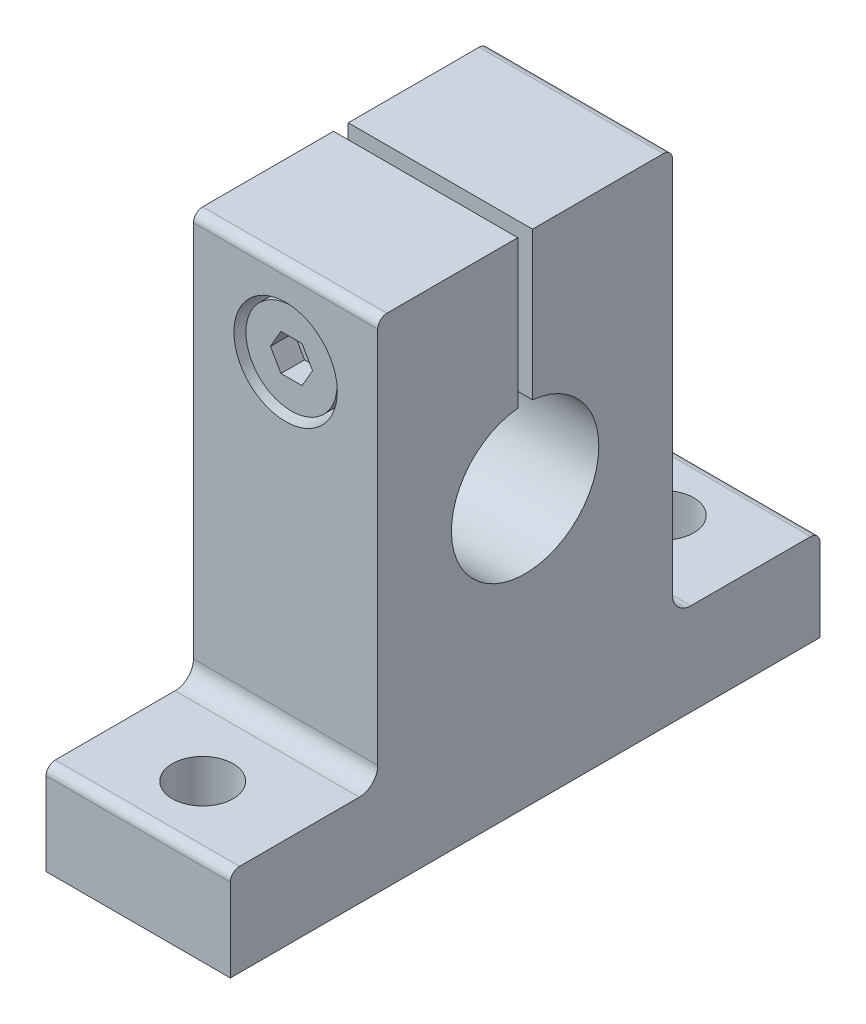
ISO-10303-21;
HEADER;
FILE_DESCRIPTION(('STEP AP214'),'2;1');
FILE_NAME('part.step','',(''),(''),'','','');
FILE_SCHEMA(('AUTOMOTIVE_DESIGN { 1 0 10303 214 1 1 1 1 }'));
ENDSEC;
DATA;
#1=APPLICATION_CONTEXT('core data for automotive mechanical design processes');
#2=APPLICATION_PROTOCOL_DEFINITION('international standard','automotive_design',2000,#1);
#3=PRODUCT_CONTEXT('',#1,'mechanical');
#4=PRODUCT('Part','Part','',(#3));
#5=PRODUCT_RELATED_PRODUCT_CATEGORY('part','',(#4));
#6=PRODUCT_DEFINITION_FORMATION('','',#4);
#7=PRODUCT_DEFINITION_CONTEXT('part definition',#1,'design');
#8=PRODUCT_DEFINITION('design','',#6,#7);
#9=PRODUCT_DEFINITION_SHAPE('','',#8);
#10=(LENGTH_UNIT() NAMED_UNIT(*) SI_UNIT(.MILLI.,.METRE.));
#11=(NAMED_UNIT(*) PLANE_ANGLE_UNIT() SI_UNIT($,.RADIAN.));
#12=(NAMED_UNIT(*) SI_UNIT($,.STERADIAN.) SOLID_ANGLE_UNIT());
#13=UNCERTAINTY_MEASURE_WITH_UNIT(LENGTH_MEASURE(1.E-05),#10,'distance_accuracy_value','');
#14=(GEOMETRIC_REPRESENTATION_CONTEXT(3) GLOBAL_UNCERTAINTY_ASSIGNED_CONTEXT((#13)) GLOBAL_UNIT_ASSIGNED_CONTEXT((#10,
#11,#12)) REPRESENTATION_CONTEXT('',''));
#15=CARTESIAN_POINT('',(0.,0.,0.));
#16=DIRECTION('',(0.,0.,1.));
#17=DIRECTION('',(1.,0.,0.));
#18=AXIS2_PLACEMENT_3D('',#15,#16,#17);
#19=CARTESIAN_POINT('',(5.,22.46,7.68));
#20=DIRECTION('',(0.,0.,1.));
#21=DIRECTION('',(1.,0.,0.));
#22=AXIS2_PLACEMENT_3D('',#19,#20,#21);
#23=PLANE('',#22);
#24=CARTESIAN_POINT('',(5.,22.46,7.68));
#25=DIRECTION('',(0.,0.,-1.));
#26=DIRECTION('',(0.,-1.,0.));
#27=AXIS2_PLACEMENT_3D('',#24,#25,#26);
#28=CIRCLE('',#27,2.475);
#29=CARTESIAN_POINT('',(5.,19.985,7.68));
#30=VERTEX_POINT('',#29);
#31=EDGE_CURVE('E199',#30,#30,#28,.T.);
#32=ORIENTED_EDGE('',*,*,#31,.F.);
#33=EDGE_LOOP('',(#32));
#34=FACE_BOUND('',#33,.T.);
#35=DIRECTION('',(1.,0.,0.));
#36=VECTOR('',#35,1.);
#37=CARTESIAN_POINT('',(5.,23.45,7.68));
#38=LINE('',#37,#36);
#39=CARTESIAN_POINT('',(4.42842323350227,23.45,7.68));
#40=VERTEX_POINT('',#39);
#41=CARTESIAN_POINT('',(5.57157676649773,23.45,7.68));
#42=VERTEX_POINT('',#41);
#43=EDGE_CURVE('E434',#40,#42,#38,.T.);
#44=ORIENTED_EDGE('',*,*,#43,.T.);
#45=DIRECTION('',(0.5,-0.866025403784439,0.));
#46=VECTOR('',#45,1.);
#47=CARTESIAN_POINT('',(5.8573651497466,22.955,7.68));
#48=LINE('',#47,#46);
#49=CARTESIAN_POINT('',(6.14315353299546,22.46,7.68));
#50=VERTEX_POINT('',#49);
#51=EDGE_CURVE('E9',#42,#50,#48,.T.);
#52=ORIENTED_EDGE('',*,*,#51,.T.);
#53=DIRECTION('',(-0.5,-0.866025403784439,0.));
#54=VECTOR('',#53,1.);
#55=CARTESIAN_POINT('',(5.8573651497466,21.965,7.68));
#56=LINE('',#55,#54);
#57=CARTESIAN_POINT('',(5.57157676649773,21.47,7.68));
#58=VERTEX_POINT('',#57);
#59=EDGE_CURVE('E24',#50,#58,#56,.T.);
#60=ORIENTED_EDGE('',*,*,#59,.T.);
#61=DIRECTION('',(-1.,0.,0.));
#62=VECTOR('',#61,1.);
#63=CARTESIAN_POINT('',(5.,21.47,7.68));
#64=LINE('',#63,#62);
#65=CARTESIAN_POINT('',(4.42842323350227,21.47,7.68));
#66=VERTEX_POINT('',#65);
#67=EDGE_CURVE('E452',#58,#66,#64,.T.);
#68=ORIENTED_EDGE('',*,*,#67,.T.);
#69=DIRECTION('',(-0.5,0.866025403784439,0.));
#70=VECTOR('',#69,1.);
#71=CARTESIAN_POINT('',(4.1426348502534,21.965,7.68));
#72=LINE('',#71,#70);
#73=CARTESIAN_POINT('',(3.85684646700454,22.46,7.68));
#74=VERTEX_POINT('',#73);
#75=EDGE_CURVE('E448',#66,#74,#72,.T.);
#76=ORIENTED_EDGE('',*,*,#75,.T.);
#77=DIRECTION('',(0.5,0.866025403784439,0.));
#78=VECTOR('',#77,1.);
#79=CARTESIAN_POINT('',(4.1426348502534,22.955,7.68));
#80=LINE('',#79,#78);
#81=EDGE_CURVE('E444',#74,#40,#80,.T.);
#82=ORIENTED_EDGE('',*,*,#81,.T.);
#83=EDGE_LOOP('',(#44,#52,#60,#68,#76,#82));
#84=FACE_BOUND('',#83,.T.);
#85=ADVANCED_FACE('F15',(#34,#84),#23,.T.);
#86=CARTESIAN_POINT('',(10.,27.,7.5));
#87=DIRECTION('',(0.,1.,0.));
#88=DIRECTION('',(0.,0.,1.));
#89=AXIS2_PLACEMENT_3D('',#86,#87,#88);
#90=PLANE('',#89);
#91=DIRECTION('',(1.,0.,0.));
#92=VECTOR('',#91,1.);
#93=CARTESIAN_POINT('',(10.,27.,0.4));
#94=LINE('',#93,#92);
#95=CARTESIAN_POINT('',(0.,27.,0.4));
#96=VERTEX_POINT('',#95);
#97=CARTESIAN_POINT('',(10.,27.,0.4));
#98=VERTEX_POINT('',#97);
#99=EDGE_CURVE('E250',#96,#98,#94,.T.);
#100=ORIENTED_EDGE('',*,*,#99,.F.);
#101=DIRECTION('',(0.,0.,-1.));
#102=VECTOR('',#101,1.);
#103=CARTESIAN_POINT('',(0.,27.,7.5));
#104=LINE('',#103,#102);
#105=CARTESIAN_POINT('',(0.,27.,7.5));
#106=VERTEX_POINT('',#105);
#107=EDGE_CURVE('E294',#106,#96,#104,.T.);
#108=ORIENTED_EDGE('',*,*,#107,.F.);
#109=DIRECTION('',(-1.,0.,0.));
#110=VECTOR('',#109,1.);
#111=CARTESIAN_POINT('',(10.,27.,7.5));
#112=LINE('',#111,#110);
#113=CARTESIAN_POINT('',(10.,27.,7.5));
#114=VERTEX_POINT('',#113);
#115=EDGE_CURVE('E386',#114,#106,#112,.T.);
#116=ORIENTED_EDGE('',*,*,#115,.F.);
#117=DIRECTION('',(0.,0.,-1.));
#118=VECTOR('',#117,1.);
#119=CARTESIAN_POINT('',(10.,27.,7.5));
#120=LINE('',#119,#118);
#121=EDGE_CURVE('E346',#114,#98,#120,.T.);
#122=ORIENTED_EDGE('',*,*,#121,.T.);
#123=EDGE_LOOP('',(#100,#108,#116,#122));
#124=FACE_BOUND('',#123,.T.);
#125=ADVANCED_FACE('F747',(#124),#90,.T.);
#126=CARTESIAN_POINT('',(10.,0.,16.));
#127=DIRECTION('',(0.,0.,1.));
#128=DIRECTION('',(1.,0.,0.));
#129=AXIS2_PLACEMENT_3D('',#126,#127,#128);
#130=PLANE('',#129);
#131=DIRECTION('',(0.,1.,0.));
#132=VECTOR('',#131,1.);
#133=CARTESIAN_POINT('',(0.,0.,16.));
#134=LINE('',#133,#132);
#135=CARTESIAN_POINT('',(0.,0.,16.));
#136=VERTEX_POINT('',#135);
#137=CARTESIAN_POINT('',(0.,4.5,16.));
#138=VERTEX_POINT('',#137);
#139=EDGE_CURVE('E268',#136,#138,#134,.T.);
#140=ORIENTED_EDGE('',*,*,#139,.F.);
#141=DIRECTION('',(-1.,0.,0.));
#142=VECTOR('',#141,1.);
#143=CARTESIAN_POINT('',(10.,0.,16.));
#144=LINE('',#143,#142);
#145=CARTESIAN_POINT('',(10.,0.,16.));
#146=VERTEX_POINT('',#145);
#147=EDGE_CURVE('E415',#146,#136,#144,.T.);
#148=ORIENTED_EDGE('',*,*,#147,.F.);
#149=DIRECTION('',(0.,1.,0.));
#150=VECTOR('',#149,1.);
#151=CARTESIAN_POINT('',(10.,0.,16.));
#152=LINE('',#151,#150);
#153=CARTESIAN_POINT('',(10.,4.5,16.));
#154=VERTEX_POINT('',#153);
#155=EDGE_CURVE('E272',#146,#154,#152,.T.);
#156=ORIENTED_EDGE('',*,*,#155,.T.);
#157=DIRECTION('',(-1.,0.,0.));
#158=VECTOR('',#157,1.);
#159=CARTESIAN_POINT('',(10.,4.5,16.));
#160=LINE('',#159,#158);
#161=EDGE_CURVE('E325',#154,#138,#160,.T.);
#162=ORIENTED_EDGE('',*,*,#161,.T.);
#163=EDGE_LOOP('',(#140,#148,#156,#162));
#164=FACE_BOUND('',#163,.T.);
#165=ADVANCED_FACE('F17',(#164),#130,.T.);
#166=CARTESIAN_POINT('',(10.,0.,16.));
#167=DIRECTION('',(0.,1.,0.));
#168=DIRECTION('',(1.,0.,0.));
#169=AXIS2_PLACEMENT_3D('',#166,#167,#168);
#170=PLANE('',#169);
#171=CARTESIAN_POINT('',(5.,0.,12.5));
#172=DIRECTION('',(0.,1.,0.));
#173=DIRECTION('',(0.,0.,1.));
#174=AXIS2_PLACEMENT_3D('',#171,#172,#173);
#175=CIRCLE('',#174,1.65);
#176=CARTESIAN_POINT('',(5.,0.,14.15));
#177=VERTEX_POINT('',#176);
#178=EDGE_CURVE('E254',#177,#177,#175,.T.);
#179=ORIENTED_EDGE('',*,*,#178,.T.);
#180=EDGE_LOOP('',(#179));
#181=FACE_BOUND('',#180,.T.);
#182=CARTESIAN_POINT('',(5.,0.,-12.5));
#183=DIRECTION('',(0.,1.,0.));
#184=DIRECTION('',(0.,0.,1.));
#185=AXIS2_PLACEMENT_3D('',#182,#183,#184);
#186=CIRCLE('',#185,1.65);
#187=CARTESIAN_POINT('',(5.,0.,-10.85));
#188=VERTEX_POINT('',#187);
#189=EDGE_CURVE('E259',#188,#188,#186,.T.);
#190=ORIENTED_EDGE('',*,*,#189,.T.);
#191=EDGE_LOOP('',(#190));
#192=FACE_BOUND('',#191,.T.);
#193=DIRECTION('',(0.,0.,-1.));
#194=VECTOR('',#193,1.);
#195=CARTESIAN_POINT('',(0.,0.,16.));
#196=LINE('',#195,#194);
#197=CARTESIAN_POINT('',(0.,0.,-16.));
#198=VERTEX_POINT('',#197);
#199=EDGE_CURVE('E269',#136,#198,#196,.T.);
#200=ORIENTED_EDGE('',*,*,#199,.T.);
#201=DIRECTION('',(-1.,0.,0.));
#202=VECTOR('',#201,1.);
#203=CARTESIAN_POINT('',(10.,0.,-16.));
#204=LINE('',#203,#202);
#205=CARTESIAN_POINT('',(10.,0.,-16.));
#206=VERTEX_POINT('',#205);
#207=EDGE_CURVE('E411',#206,#198,#204,.T.);
#208=ORIENTED_EDGE('',*,*,#207,.F.);
#209=DIRECTION('',(0.,0.,-1.));
#210=VECTOR('',#209,1.);
#211=CARTESIAN_POINT('',(10.,0.,16.));
#212=LINE('',#211,#210);
#213=EDGE_CURVE('E322',#146,#206,#212,.T.);
#214=ORIENTED_EDGE('',*,*,#213,.F.);
#215=ORIENTED_EDGE('',*,*,#147,.T.);
#216=EDGE_LOOP('',(#200,#208,#214,#215));
#217=FACE_BOUND('',#216,.T.);
#218=ADVANCED_FACE('F805',(#181,#192,#217),#170,.F.);
#219=CARTESIAN_POINT('',(10.,0.,-16.));
#220=DIRECTION('',(0.,0.,1.));
#221=DIRECTION('',(1.,0.,0.));
#222=AXIS2_PLACEMENT_3D('',#219,#220,#221);
#223=PLANE('',#222);
#224=DIRECTION('',(0.,1.,0.));
#225=VECTOR('',#224,1.);
#226=CARTESIAN_POINT('',(0.,0.,-16.));
#227=LINE('',#226,#225);
#228=CARTESIAN_POINT('',(0.,4.5,-16.));
#229=VERTEX_POINT('',#228);
#230=EDGE_CURVE('E273',#198,#229,#227,.T.);
#231=ORIENTED_EDGE('',*,*,#230,.T.);
#232=DIRECTION('',(-1.,0.,0.));
#233=VECTOR('',#232,1.);
#234=CARTESIAN_POINT('',(10.,4.5,-16.));
#235=LINE('',#234,#233);
#236=CARTESIAN_POINT('',(10.,4.5,-16.));
#237=VERTEX_POINT('',#236);
#238=EDGE_CURVE('E407',#237,#229,#235,.T.);
#239=ORIENTED_EDGE('',*,*,#238,.F.);
#240=DIRECTION('',(0.,1.,0.));
#241=VECTOR('',#240,1.);
#242=CARTESIAN_POINT('',(10.,0.,-16.));
#243=LINE('',#242,#241);
#244=EDGE_CURVE('E326',#206,#237,#243,.T.);
#245=ORIENTED_EDGE('',*,*,#244,.F.);
#246=ORIENTED_EDGE('',*,*,#207,.T.);
#247=EDGE_LOOP('',(#231,#239,#245,#246));
#248=FACE_BOUND('',#247,.T.);
#249=ADVANCED_FACE('F795',(#248),#223,.F.);
#250=CARTESIAN_POINT('',(10.,4.5,-15.5));
#251=DIRECTION('',(-1.,0.,0.));
#252=DIRECTION('',(0.,0.,1.));
#253=AXIS2_PLACEMENT_3D('',#250,#251,#252);
#254=CYLINDRICAL_SURFACE('',#253,0.5);
#255=CARTESIAN_POINT('',(0.,4.5,-15.5));
#256=DIRECTION('',(1.,0.,0.));
#257=DIRECTION('',(0.,0.,-1.));
#258=AXIS2_PLACEMENT_3D('',#255,#256,#257);
#259=CIRCLE('',#258,0.5);
#260=CARTESIAN_POINT('',(0.,5.,-15.5));
#261=VERTEX_POINT('',#260);
#262=EDGE_CURVE('E276',#229,#261,#259,.T.);
#263=ORIENTED_EDGE('',*,*,#262,.T.);
#264=DIRECTION('',(-1.,0.,0.));
#265=VECTOR('',#264,1.);
#266=CARTESIAN_POINT('',(10.,5.,-15.5));
#267=LINE('',#266,#265);
#268=CARTESIAN_POINT('',(10.,5.,-15.5));
#269=VERTEX_POINT('',#268);
#270=EDGE_CURVE('E403',#269,#261,#267,.T.);
#271=ORIENTED_EDGE('',*,*,#270,.F.);
#272=CARTESIAN_POINT('',(10.,4.5,-15.5));
#273=DIRECTION('',(1.,0.,0.));
#274=DIRECTION('',(0.,0.,-1.));
#275=AXIS2_PLACEMENT_3D('',#272,#273,#274);
#276=CIRCLE('',#275,0.5);
#277=EDGE_CURVE('E329',#237,#269,#276,.T.);
#278=ORIENTED_EDGE('',*,*,#277,.F.);
#279=ORIENTED_EDGE('',*,*,#238,.T.);
#280=EDGE_LOOP('',(#263,#271,#278,#279));
#281=FACE_BOUND('',#280,.T.);
#282=ADVANCED_FACE('F785',(#281),#254,.T.);
#283=CARTESIAN_POINT('',(10.,5.,-15.5));
#284=DIRECTION('',(0.,-1.,0.));
#285=DIRECTION('',(0.,0.,-1.));
#286=AXIS2_PLACEMENT_3D('',#283,#284,#285);
#287=PLANE('',#286);
#288=CARTESIAN_POINT('',(5.,5.,-12.5));
#289=DIRECTION('',(0.,-1.,0.));
#290=DIRECTION('',(0.,0.,-1.));
#291=AXIS2_PLACEMENT_3D('',#288,#289,#290);
#292=CIRCLE('',#291,1.65);
#293=CARTESIAN_POINT('',(5.,5.,-14.15));
#294=VERTEX_POINT('',#293);
#295=EDGE_CURVE('E258',#294,#294,#292,.T.);
#296=ORIENTED_EDGE('',*,*,#295,.T.);
#297=EDGE_LOOP('',(#296));
#298=FACE_BOUND('',#297,.T.);
#299=DIRECTION('',(0.,0.,1.));
#300=VECTOR('',#299,1.);
#301=CARTESIAN_POINT('',(0.,5.,-15.5));
#302=LINE('',#301,#300);
#303=CARTESIAN_POINT('',(0.,5.,-9.));
#304=VERTEX_POINT('',#303);
#305=EDGE_CURVE('E279',#261,#304,#302,.T.);
#306=ORIENTED_EDGE('',*,*,#305,.T.);
#307=DIRECTION('',(-1.,0.,0.));
#308=VECTOR('',#307,1.);
#309=CARTESIAN_POINT('',(10.,5.,-9.));
#310=LINE('',#309,#308);
#311=CARTESIAN_POINT('',(10.,5.,-9.));
#312=VERTEX_POINT('',#311);
#313=EDGE_CURVE('E400',#312,#304,#310,.T.);
#314=ORIENTED_EDGE('',*,*,#313,.F.);
#315=DIRECTION('',(0.,0.,1.));
#316=VECTOR('',#315,1.);
#317=CARTESIAN_POINT('',(10.,5.,-15.5));
#318=LINE('',#317,#316);
#319=EDGE_CURVE('E332',#269,#312,#318,.T.);
#320=ORIENTED_EDGE('',*,*,#319,.F.);
#321=ORIENTED_EDGE('',*,*,#270,.T.);
#322=EDGE_LOOP('',(#306,#314,#320,#321));
#323=FACE_BOUND('',#322,.T.);
#324=ADVANCED_FACE('F775',(#298,#323),#287,.F.);
#325=CARTESIAN_POINT('',(10.,6.,-9.));
#326=DIRECTION('',(-1.,0.,0.));
#327=DIRECTION('',(0.,0.,1.));
#328=AXIS2_PLACEMENT_3D('',#325,#326,#327);
#329=CYLINDRICAL_SURFACE('',#328,1.);
#330=CARTESIAN_POINT('',(0.,6.,-9.));
#331=DIRECTION('',(1.,0.,0.));
#332=DIRECTION('',(0.,0.,-1.));
#333=AXIS2_PLACEMENT_3D('',#330,#331,#332);
#334=CIRCLE('',#333,1.);
#335=CARTESIAN_POINT('',(0.,6.,-8.));
#336=VERTEX_POINT('',#335);
#337=EDGE_CURVE('E283',#336,#304,#334,.T.);
#338=ORIENTED_EDGE('',*,*,#337,.F.);
#339=DIRECTION('',(-1.,0.,0.));
#340=VECTOR('',#339,1.);
#341=CARTESIAN_POINT('',(10.,6.,-8.));
#342=LINE('',#341,#340);
#343=CARTESIAN_POINT('',(10.,6.,-8.));
#344=VERTEX_POINT('',#343);
#345=EDGE_CURVE('E397',#344,#336,#342,.T.);
#346=ORIENTED_EDGE('',*,*,#345,.F.);
#347=CARTESIAN_POINT('',(10.,6.,-9.));
#348=DIRECTION('',(1.,0.,0.));
#349=DIRECTION('',(0.,0.,-1.));
#350=AXIS2_PLACEMENT_3D('',#347,#348,#349);
#351=CIRCLE('',#350,1.);
#352=EDGE_CURVE('E335',#344,#312,#351,.T.);
#353=ORIENTED_EDGE('',*,*,#352,.T.);
#354=ORIENTED_EDGE('',*,*,#313,.T.);
#355=EDGE_LOOP('',(#338,#346,#353,#354));
#356=FACE_BOUND('',#355,.T.);
#357=ADVANCED_FACE('F765',(#356),#329,.F.);
#358=CARTESIAN_POINT('',(10.,6.,-8.));
#359=DIRECTION('',(0.,0.,1.));
#360=DIRECTION('',(0.,-1.,0.));
#361=AXIS2_PLACEMENT_3D('',#358,#359,#360);
#362=PLANE('',#361);
#363=CARTESIAN_POINT('',(5.,22.46,-8.));
#364=DIRECTION('',(0.,0.,1.));
#365=DIRECTION('',(0.,-1.,0.));
#366=AXIS2_PLACEMENT_3D('',#363,#364,#365);
#367=CIRCLE('',#366,1.32);
#368=CARTESIAN_POINT('',(5.,21.14,-8.));
#369=VERTEX_POINT('',#368);
#370=EDGE_CURVE('E231',#369,#369,#367,.T.);
#371=ORIENTED_EDGE('',*,*,#370,.T.);
#372=EDGE_LOOP('',(#371));
#373=FACE_BOUND('',#372,.T.);
#374=DIRECTION('',(0.,1.,0.));
#375=VECTOR('',#374,1.);
#376=CARTESIAN_POINT('',(0.,6.,-8.));
#377=LINE('',#376,#375);
#378=CARTESIAN_POINT('',(0.,26.5,-8.));
#379=VERTEX_POINT('',#378);
#380=EDGE_CURVE('E287',#336,#379,#377,.T.);
#381=ORIENTED_EDGE('',*,*,#380,.T.);
#382=DIRECTION('',(-1.,0.,0.));
#383=VECTOR('',#382,1.);
#384=CARTESIAN_POINT('',(10.,26.5,-8.));
#385=LINE('',#384,#383);
#386=CARTESIAN_POINT('',(10.,26.5,-8.));
#387=VERTEX_POINT('',#386);
#388=EDGE_CURVE('E393',#387,#379,#385,.T.);
#389=ORIENTED_EDGE('',*,*,#388,.F.);
#390=DIRECTION('',(0.,1.,0.));
#391=VECTOR('',#390,1.);
#392=CARTESIAN_POINT('',(10.,6.,-8.));
#393=LINE('',#392,#391);
#394=EDGE_CURVE('E339',#344,#387,#393,.T.);
#395=ORIENTED_EDGE('',*,*,#394,.F.);
#396=ORIENTED_EDGE('',*,*,#345,.T.);
#397=EDGE_LOOP('',(#381,#389,#395,#396));
#398=FACE_BOUND('',#397,.T.);
#399=ADVANCED_FACE('F755',(#373,#398),#362,.F.);
#400=CARTESIAN_POINT('',(10.,26.5,-7.5));
#401=DIRECTION('',(-1.,0.,0.));
#402=DIRECTION('',(0.,0.,1.));
#403=AXIS2_PLACEMENT_3D('',#400,#401,#402);
#404=CYLINDRICAL_SURFACE('',#403,0.5);
#405=CARTESIAN_POINT('',(0.,26.5,-7.5));
#406=DIRECTION('',(1.,0.,0.));
#407=DIRECTION('',(0.,0.,-1.));
#408=AXIS2_PLACEMENT_3D('',#405,#406,#407);
#409=CIRCLE('',#408,0.5);
#410=CARTESIAN_POINT('',(0.,27.,-7.5));
#411=VERTEX_POINT('',#410);
#412=EDGE_CURVE('E290',#379,#411,#409,.T.);
#413=ORIENTED_EDGE('',*,*,#412,.T.);
#414=DIRECTION('',(-1.,0.,0.));
#415=VECTOR('',#414,1.);
#416=CARTESIAN_POINT('',(10.,27.,-7.5));
#417=LINE('',#416,#415);
#418=CARTESIAN_POINT('',(10.,27.,-7.5));
#419=VERTEX_POINT('',#418);
#420=EDGE_CURVE('E389',#419,#411,#417,.T.);
#421=ORIENTED_EDGE('',*,*,#420,.F.);
#422=CARTESIAN_POINT('',(10.,26.5,-7.5));
#423=DIRECTION('',(1.,0.,0.));
#424=DIRECTION('',(0.,0.,-1.));
#425=AXIS2_PLACEMENT_3D('',#422,#423,#424);
#426=CIRCLE('',#425,0.5);
#427=EDGE_CURVE('E342',#387,#419,#426,.T.);
#428=ORIENTED_EDGE('',*,*,#427,.F.);
#429=ORIENTED_EDGE('',*,*,#388,.T.);
#430=EDGE_LOOP('',(#413,#421,#428,#429));
#431=FACE_BOUND('',#430,.T.);
#432=ADVANCED_FACE('F744',(#431),#404,.T.);
#433=DIRECTION('',(-1.,0.,0.));
#434=VECTOR('',#433,1.);
#435=CARTESIAN_POINT('',(10.,27.,-0.4));
#436=LINE('',#435,#434);
#437=CARTESIAN_POINT('',(10.,27.,-0.4));
#438=VERTEX_POINT('',#437);
#439=CARTESIAN_POINT('',(0.,27.,-0.4));
#440=VERTEX_POINT('',#439);
#441=EDGE_CURVE('E240',#438,#440,#436,.T.);
#442=ORIENTED_EDGE('',*,*,#441,.F.);
#443=EDGE_CURVE('E350',#438,#419,#120,.T.);
#444=ORIENTED_EDGE('',*,*,#443,.T.);
#445=ORIENTED_EDGE('',*,*,#420,.T.);
#446=EDGE_CURVE('E298',#440,#411,#104,.T.);
#447=ORIENTED_EDGE('',*,*,#446,.F.);
#448=EDGE_LOOP('',(#442,#444,#445,#447));
#449=FACE_BOUND('',#448,.T.);
#450=ADVANCED_FACE('F733',(#449),#90,.T.);
#451=CARTESIAN_POINT('',(10.,26.5,7.5));
#452=DIRECTION('',(-1.,0.,0.));
#453=DIRECTION('',(0.,0.,1.));
#454=AXIS2_PLACEMENT_3D('',#451,#452,#453);
#455=CYLINDRICAL_SURFACE('',#454,0.5);
#456=CARTESIAN_POINT('',(0.,26.5,7.5));
#457=DIRECTION('',(1.,0.,0.));
#458=DIRECTION('',(0.,0.,-1.));
#459=AXIS2_PLACEMENT_3D('',#456,#457,#458);
#460=CIRCLE('',#459,0.5);
#461=CARTESIAN_POINT('',(0.,26.5,8.));
#462=VERTEX_POINT('',#461);
#463=EDGE_CURVE('E299',#106,#462,#460,.T.);
#464=ORIENTED_EDGE('',*,*,#463,.T.);
#465=DIRECTION('',(-1.,0.,0.));
#466=VECTOR('',#465,1.);
#467=CARTESIAN_POINT('',(10.,26.5,8.));
#468=LINE('',#467,#466);
#469=CARTESIAN_POINT('',(10.,26.5,8.));
#470=VERTEX_POINT('',#469);
#471=EDGE_CURVE('E383',#470,#462,#468,.T.);
#472=ORIENTED_EDGE('',*,*,#471,.F.);
#473=CARTESIAN_POINT('',(10.,26.5,7.5));
#474=DIRECTION('',(1.,0.,0.));
#475=DIRECTION('',(0.,0.,-1.));
#476=AXIS2_PLACEMENT_3D('',#473,#474,#475);
#477=CIRCLE('',#476,0.5);
#478=EDGE_CURVE('E351',#114,#470,#477,.T.);
#479=ORIENTED_EDGE('',*,*,#478,.F.);
#480=ORIENTED_EDGE('',*,*,#115,.T.);
#481=EDGE_LOOP('',(#464,#472,#479,#480));
#482=FACE_BOUND('',#481,.T.);
#483=ADVANCED_FACE('F723',(#482),#455,.T.);
#484=CARTESIAN_POINT('',(10.,6.,8.));
#485=DIRECTION('',(0.,0.,1.));
#486=DIRECTION('',(0.,-1.,0.));
#487=AXIS2_PLACEMENT_3D('',#484,#485,#486);
#488=PLANE('',#487);
#489=CARTESIAN_POINT('',(5.,22.46,8.));
#490=DIRECTION('',(0.,0.,1.));
#491=DIRECTION('',(0.,-1.,0.));
#492=AXIS2_PLACEMENT_3D('',#489,#490,#491);
#493=CIRCLE('',#492,2.805);
#494=CARTESIAN_POINT('',(5.,19.655,8.));
#495=VERTEX_POINT('',#494);
#496=EDGE_CURVE('E230',#495,#495,#493,.T.);
#497=ORIENTED_EDGE('',*,*,#496,.F.);
#498=EDGE_LOOP('',(#497));
#499=FACE_BOUND('',#498,.T.);
#500=DIRECTION('',(0.,1.,0.));
#501=VECTOR('',#500,1.);
#502=CARTESIAN_POINT('',(0.,6.,8.));
#503=LINE('',#502,#501);
#504=CARTESIAN_POINT('',(0.,6.,8.));
#505=VERTEX_POINT('',#504);
#506=EDGE_CURVE('E303',#505,#462,#503,.T.);
#507=ORIENTED_EDGE('',*,*,#506,.F.);
#508=DIRECTION('',(-1.,0.,0.));
#509=VECTOR('',#508,1.);
#510=CARTESIAN_POINT('',(10.,6.,8.));
#511=LINE('',#510,#509);
#512=CARTESIAN_POINT('',(10.,6.,8.));
#513=VERTEX_POINT('',#512);
#514=EDGE_CURVE('E380',#513,#505,#511,.T.);
#515=ORIENTED_EDGE('',*,*,#514,.F.);
#516=DIRECTION('',(0.,1.,0.));
#517=VECTOR('',#516,1.);
#518=CARTESIAN_POINT('',(10.,6.,8.));
#519=LINE('',#518,#517);
#520=EDGE_CURVE('E354',#513,#470,#519,.T.);
#521=ORIENTED_EDGE('',*,*,#520,.T.);
#522=ORIENTED_EDGE('',*,*,#471,.T.);
#523=EDGE_LOOP('',(#507,#515,#521,#522));
#524=FACE_BOUND('',#523,.T.);
#525=ADVANCED_FACE('F713',(#499,#524),#488,.T.);
#526=CARTESIAN_POINT('',(10.,6.,9.));
#527=DIRECTION('',(-1.,0.,0.));
#528=DIRECTION('',(0.,0.,1.));
#529=AXIS2_PLACEMENT_3D('',#526,#527,#528);
#530=CYLINDRICAL_SURFACE('',#529,1.);
#531=CARTESIAN_POINT('',(0.,6.,9.));
#532=DIRECTION('',(1.,0.,0.));
#533=DIRECTION('',(0.,0.,-1.));
#534=AXIS2_PLACEMENT_3D('',#531,#532,#533);
#535=CIRCLE('',#534,1.);
#536=CARTESIAN_POINT('',(0.,5.,9.));
#537=VERTEX_POINT('',#536);
#538=EDGE_CURVE('E307',#537,#505,#535,.T.);
#539=ORIENTED_EDGE('',*,*,#538,.F.);
#540=DIRECTION('',(-1.,0.,0.));
#541=VECTOR('',#540,1.);
#542=CARTESIAN_POINT('',(10.,5.,9.));
#543=LINE('',#542,#541);
#544=CARTESIAN_POINT('',(10.,5.,9.));
#545=VERTEX_POINT('',#544);
#546=EDGE_CURVE('E377',#545,#537,#543,.T.);
#547=ORIENTED_EDGE('',*,*,#546,.F.);
#548=CARTESIAN_POINT('',(10.,6.,9.));
#549=DIRECTION('',(1.,0.,0.));
#550=DIRECTION('',(0.,0.,-1.));
#551=AXIS2_PLACEMENT_3D('',#548,#549,#550);
#552=CIRCLE('',#551,1.);
#553=EDGE_CURVE('E358',#545,#513,#552,.T.);
#554=ORIENTED_EDGE('',*,*,#553,.T.);
#555=ORIENTED_EDGE('',*,*,#514,.T.);
#556=EDGE_LOOP('',(#539,#547,#554,#555));
#557=FACE_BOUND('',#556,.T.);
#558=ADVANCED_FACE('F703',(#557),#530,.F.);
#559=CARTESIAN_POINT('',(10.,5.,15.5));
#560=DIRECTION('',(0.,1.,0.));
#561=DIRECTION('',(0.,0.,1.));
#562=AXIS2_PLACEMENT_3D('',#559,#560,#561);
#563=PLANE('',#562);
#564=CARTESIAN_POINT('',(5.,5.00000000000015,12.5));
#565=DIRECTION('',(0.,1.,0.));
#566=DIRECTION('',(0.,0.,1.));
#567=AXIS2_PLACEMENT_3D('',#564,#565,#566);
#568=CIRCLE('',#567,1.65);
#569=CARTESIAN_POINT('',(5.,5.00000000000007,14.15));
#570=VERTEX_POINT('',#569);
#571=EDGE_CURVE('E253',#570,#570,#568,.T.);
#572=ORIENTED_EDGE('',*,*,#571,.F.);
#573=EDGE_LOOP('',(#572));
#574=FACE_BOUND('',#573,.T.);
#575=DIRECTION('',(0.,0.,-1.));
#576=VECTOR('',#575,1.);
#577=CARTESIAN_POINT('',(0.,5.,15.5));
#578=LINE('',#577,#576);
#579=CARTESIAN_POINT('',(0.,5.,15.5));
#580=VERTEX_POINT('',#579);
#581=EDGE_CURVE('E311',#580,#537,#578,.T.);
#582=ORIENTED_EDGE('',*,*,#581,.F.);
#583=DIRECTION('',(-1.,0.,0.));
#584=VECTOR('',#583,1.);
#585=CARTESIAN_POINT('',(10.,5.,15.5));
#586=LINE('',#585,#584);
#587=CARTESIAN_POINT('',(10.,5.,15.5));
#588=VERTEX_POINT('',#587);
#589=EDGE_CURVE('E374',#588,#580,#586,.T.);
#590=ORIENTED_EDGE('',*,*,#589,.F.);
#591=DIRECTION('',(0.,0.,-1.));
#592=VECTOR('',#591,1.);
#593=CARTESIAN_POINT('',(10.,5.,15.5));
#594=LINE('',#593,#592);
#595=EDGE_CURVE('E362',#588,#545,#594,.T.);
#596=ORIENTED_EDGE('',*,*,#595,.T.);
#597=ORIENTED_EDGE('',*,*,#546,.T.);
#598=EDGE_LOOP('',(#582,#590,#596,#597));
#599=FACE_BOUND('',#598,.T.);
#600=ADVANCED_FACE('F694',(#574,#599),#563,.T.);
#601=CARTESIAN_POINT('',(10.,4.5,15.5));
#602=DIRECTION('',(-1.,0.,0.));
#603=DIRECTION('',(0.,0.,1.));
#604=AXIS2_PLACEMENT_3D('',#601,#602,#603);
#605=CYLINDRICAL_SURFACE('',#604,0.5);
#606=CARTESIAN_POINT('',(0.,4.5,15.5));
#607=DIRECTION('',(1.,0.,0.));
#608=DIRECTION('',(0.,0.,-1.));
#609=AXIS2_PLACEMENT_3D('',#606,#607,#608);
#610=CIRCLE('',#609,0.5);
#611=EDGE_CURVE('E315',#580,#138,#610,.T.);
#612=ORIENTED_EDGE('',*,*,#611,.T.);
#613=ORIENTED_EDGE('',*,*,#161,.F.);
#614=CARTESIAN_POINT('',(10.,4.5,15.5));
#615=DIRECTION('',(1.,0.,0.));
#616=DIRECTION('',(0.,0.,-1.));
#617=AXIS2_PLACEMENT_3D('',#614,#615,#616);
#618=CIRCLE('',#617,0.5);
#619=EDGE_CURVE('E366',#588,#154,#618,.T.);
#620=ORIENTED_EDGE('',*,*,#619,.F.);
#621=ORIENTED_EDGE('',*,*,#589,.T.);
#622=EDGE_LOOP('',(#612,#613,#620,#621));
#623=FACE_BOUND('',#622,.T.);
#624=ADVANCED_FACE('F684',(#623),#605,.T.);
#625=CARTESIAN_POINT('',(10.,4.5,15.5));
#626=DIRECTION('',(1.,0.,0.));
#627=DIRECTION('',(0.,0.,-1.));
#628=AXIS2_PLACEMENT_3D('',#625,#626,#627);
#629=PLANE('',#628);
#630=DIRECTION('',(0.,-1.,0.));
#631=VECTOR('',#630,1.);
#632=CARTESIAN_POINT('',(10.,4.5,0.4));
#633=LINE('',#632,#631);
#634=CARTESIAN_POINT('',(10.,18.9799497484265,0.4));
#635=VERTEX_POINT('',#634);
#636=EDGE_CURVE('E247',#98,#635,#633,.T.);
#637=ORIENTED_EDGE('',*,*,#636,.F.);
#638=ORIENTED_EDGE('',*,*,#121,.F.);
#639=ORIENTED_EDGE('',*,*,#478,.T.);
#640=ORIENTED_EDGE('',*,*,#520,.F.);
#641=ORIENTED_EDGE('',*,*,#553,.F.);
#642=ORIENTED_EDGE('',*,*,#595,.F.);
#643=ORIENTED_EDGE('',*,*,#619,.T.);
#644=ORIENTED_EDGE('',*,*,#155,.F.);
#645=ORIENTED_EDGE('',*,*,#213,.T.);
#646=ORIENTED_EDGE('',*,*,#244,.T.);
#647=ORIENTED_EDGE('',*,*,#277,.T.);
#648=ORIENTED_EDGE('',*,*,#319,.T.);
#649=ORIENTED_EDGE('',*,*,#352,.F.);
#650=ORIENTED_EDGE('',*,*,#394,.T.);
#651=ORIENTED_EDGE('',*,*,#427,.T.);
#652=ORIENTED_EDGE('',*,*,#443,.F.);
#653=DIRECTION('',(0.,1.,0.));
#654=VECTOR('',#653,1.);
#655=CARTESIAN_POINT('',(10.,4.5,-0.4));
#656=LINE('',#655,#654);
#657=CARTESIAN_POINT('',(10.,18.9799497484265,-0.4));
#658=VERTEX_POINT('',#657);
#659=EDGE_CURVE('E237',#658,#438,#656,.T.);
#660=ORIENTED_EDGE('',*,*,#659,.F.);
#661=CARTESIAN_POINT('',(10.,15.,0.));
#662=DIRECTION('',(1.,0.,0.));
#663=DIRECTION('',(0.,0.,-1.));
#664=AXIS2_PLACEMENT_3D('',#661,#662,#663);
#665=CIRCLE('',#664,4.);
#666=EDGE_CURVE('E264',#635,#658,#665,.T.);
#667=ORIENTED_EDGE('',*,*,#666,.F.);
#668=EDGE_LOOP('',(#637,#638,#639,#640,#641,#642,#643,#644,#645,#646,#647,#648,#649,#650,#651,
#652,#660,#667));
#669=FACE_BOUND('',#668,.T.);
#670=ADVANCED_FACE('F674',(#669),#629,.T.);
#671=CARTESIAN_POINT('',(0.,4.5,15.5));
#672=DIRECTION('',(1.,0.,0.));
#673=DIRECTION('',(0.,0.,-1.));
#674=AXIS2_PLACEMENT_3D('',#671,#672,#673);
#675=PLANE('',#674);
#676=ORIENTED_EDGE('',*,*,#107,.T.);
#677=DIRECTION('',(0.,-1.,0.));
#678=VECTOR('',#677,1.);
#679=CARTESIAN_POINT('',(0.,4.5,0.4));
#680=LINE('',#679,#678);
#681=CARTESIAN_POINT('',(0.,18.9799497484265,0.4));
#682=VERTEX_POINT('',#681);
#683=EDGE_CURVE('E243',#96,#682,#680,.T.);
#684=ORIENTED_EDGE('',*,*,#683,.T.);
#685=CARTESIAN_POINT('',(0.,15.,0.));
#686=DIRECTION('',(1.,0.,0.));
#687=DIRECTION('',(0.,0.,-1.));
#688=AXIS2_PLACEMENT_3D('',#685,#686,#687);
#689=CIRCLE('',#688,4.);
#690=CARTESIAN_POINT('',(0.,18.9799497484265,-0.4));
#691=VERTEX_POINT('',#690);
#692=EDGE_CURVE('E263',#682,#691,#689,.T.);
#693=ORIENTED_EDGE('',*,*,#692,.T.);
#694=DIRECTION('',(0.,1.,0.));
#695=VECTOR('',#694,1.);
#696=CARTESIAN_POINT('',(0.,4.5,-0.4));
#697=LINE('',#696,#695);
#698=EDGE_CURVE('E39',#691,#440,#697,.T.);
#699=ORIENTED_EDGE('',*,*,#698,.T.);
#700=ORIENTED_EDGE('',*,*,#446,.T.);
#701=ORIENTED_EDGE('',*,*,#412,.F.);
#702=ORIENTED_EDGE('',*,*,#380,.F.);
#703=ORIENTED_EDGE('',*,*,#337,.T.);
#704=ORIENTED_EDGE('',*,*,#305,.F.);
#705=ORIENTED_EDGE('',*,*,#262,.F.);
#706=ORIENTED_EDGE('',*,*,#230,.F.);
#707=ORIENTED_EDGE('',*,*,#199,.F.);
#708=ORIENTED_EDGE('',*,*,#139,.T.);
#709=ORIENTED_EDGE('',*,*,#611,.F.);
#710=ORIENTED_EDGE('',*,*,#581,.T.);
#711=ORIENTED_EDGE('',*,*,#538,.T.);
#712=ORIENTED_EDGE('',*,*,#506,.T.);
#713=ORIENTED_EDGE('',*,*,#463,.F.);
#714=EDGE_LOOP('',(#676,#684,#693,#699,#700,#701,#702,#703,#704,#705,#706,#707,#708,#709,#710,
#711,#712,#713));
#715=FACE_BOUND('',#714,.T.);
#716=ADVANCED_FACE('F664',(#715),#675,.F.);
#717=CARTESIAN_POINT('',(-10.,15.,0.));
#718=DIRECTION('',(1.,0.,0.));
#719=DIRECTION('',(0.,-1.,0.));
#720=AXIS2_PLACEMENT_3D('',#717,#718,#719);
#721=CYLINDRICAL_SURFACE('',#720,4.);
#722=ORIENTED_EDGE('',*,*,#692,.F.);
#723=DIRECTION('',(1.,0.,0.));
#724=VECTOR('',#723,1.);
#725=CARTESIAN_POINT('',(-10.,18.9799497484265,0.4));
#726=LINE('',#725,#724);
#727=EDGE_CURVE('E430',#682,#635,#726,.T.);
#728=ORIENTED_EDGE('',*,*,#727,.T.);
#729=ORIENTED_EDGE('',*,*,#666,.T.);
#730=DIRECTION('',(1.,0.,0.));
#731=VECTOR('',#730,1.);
#732=CARTESIAN_POINT('',(-10.,18.9799497484265,-0.4));
#733=LINE('',#732,#731);
#734=EDGE_CURVE('E418',#658,#691,#733,.F.);
#735=ORIENTED_EDGE('',*,*,#734,.T.);
#736=EDGE_LOOP('',(#722,#728,#729,#735));
#737=FACE_BOUND('',#736,.T.);
#738=ADVANCED_FACE('F654',(#737),#721,.F.);
#739=CARTESIAN_POINT('',(5.,-10.,-12.5));
#740=DIRECTION('',(0.,1.,0.));
#741=DIRECTION('',(1.,0.,0.));
#742=AXIS2_PLACEMENT_3D('',#739,#740,#741);
#743=CYLINDRICAL_SURFACE('',#742,1.65);
#744=ORIENTED_EDGE('',*,*,#295,.F.);
#745=EDGE_LOOP('',(#744));
#746=FACE_BOUND('',#745,.T.);
#747=ORIENTED_EDGE('',*,*,#189,.F.);
#748=EDGE_LOOP('',(#747));
#749=FACE_BOUND('',#748,.T.);
#750=ADVANCED_FACE('F644',(#746,#749),#743,.F.);
#751=CARTESIAN_POINT('',(5.,-10.,12.5));
#752=DIRECTION('',(0.,1.,0.));
#753=DIRECTION('',(1.,0.,0.));
#754=AXIS2_PLACEMENT_3D('',#751,#752,#753);
#755=CYLINDRICAL_SURFACE('',#754,1.65);
#756=ORIENTED_EDGE('',*,*,#571,.T.);
#757=EDGE_LOOP('',(#756));
#758=FACE_BOUND('',#757,.T.);
#759=ORIENTED_EDGE('',*,*,#178,.F.);
#760=EDGE_LOOP('',(#759));
#761=FACE_BOUND('',#760,.T.);
#762=ADVANCED_FACE('F634',(#758,#761),#755,.F.);
#763=CARTESIAN_POINT('',(5.,28.5,-0.4));
#764=DIRECTION('',(0.,0.,-1.));
#765=DIRECTION('',(-1.,0.,0.));
#766=AXIS2_PLACEMENT_3D('',#763,#764,#765);
#767=PLANE('',#766);
#768=CARTESIAN_POINT('',(5.,22.46,-0.4));
#769=DIRECTION('',(0.,0.,-1.));
#770=DIRECTION('',(-1.,0.,0.));
#771=AXIS2_PLACEMENT_3D('',#768,#769,#770);
#772=CIRCLE('',#771,1.485);
#773=CARTESIAN_POINT('',(3.515,22.46,-0.4));
#774=VERTEX_POINT('',#773);
#775=EDGE_CURVE('E221',#774,#774,#772,.T.);
#776=ORIENTED_EDGE('',*,*,#775,.T.);
#777=EDGE_LOOP('',(#776));
#778=FACE_BOUND('',#777,.T.);
#779=ORIENTED_EDGE('',*,*,#441,.T.);
#780=ORIENTED_EDGE('',*,*,#698,.F.);
#781=ORIENTED_EDGE('',*,*,#734,.F.);
#782=ORIENTED_EDGE('',*,*,#659,.T.);
#783=EDGE_LOOP('',(#779,#780,#781,#782));
#784=FACE_BOUND('',#783,.T.);
#785=ADVANCED_FACE('F624',(#778,#784),#767,.F.);
#786=CARTESIAN_POINT('',(5.,28.5,0.4));
#787=DIRECTION('',(0.,0.,1.));
#788=DIRECTION('',(1.,0.,0.));
#789=AXIS2_PLACEMENT_3D('',#786,#787,#788);
#790=PLANE('',#789);
#791=CARTESIAN_POINT('',(5.,22.46,0.4));
#792=DIRECTION('',(0.,0.,1.));
#793=DIRECTION('',(1.,0.,0.));
#794=AXIS2_PLACEMENT_3D('',#791,#792,#793);
#795=CIRCLE('',#794,1.485);
#796=CARTESIAN_POINT('',(6.485,22.46,0.4));
#797=VERTEX_POINT('',#796);
#798=EDGE_CURVE('E217',#797,#797,#795,.T.);
#799=ORIENTED_EDGE('',*,*,#798,.T.);
#800=EDGE_LOOP('',(#799));
#801=FACE_BOUND('',#800,.T.);
#802=ORIENTED_EDGE('',*,*,#99,.T.);
#803=ORIENTED_EDGE('',*,*,#636,.T.);
#804=ORIENTED_EDGE('',*,*,#727,.F.);
#805=ORIENTED_EDGE('',*,*,#683,.F.);
#806=EDGE_LOOP('',(#802,#803,#804,#805));
#807=FACE_BOUND('',#806,.T.);
#808=ADVANCED_FACE('F614',(#801,#807),#790,.F.);
#809=CARTESIAN_POINT('',(5.,22.46,-16.));
#810=DIRECTION('',(0.,0.,1.));
#811=DIRECTION('',(0.,1.,0.));
#812=AXIS2_PLACEMENT_3D('',#809,#810,#811);
#813=CYLINDRICAL_SURFACE('',#812,1.32);
#814=CARTESIAN_POINT('',(5.,22.46,-5.8));
#815=DIRECTION('',(0.,0.,-1.));
#816=DIRECTION('',(-1.,0.,0.));
#817=AXIS2_PLACEMENT_3D('',#814,#815,#816);
#818=CIRCLE('',#817,1.32);
#819=CARTESIAN_POINT('',(3.68,22.46,-5.8));
#820=VERTEX_POINT('',#819);
#821=EDGE_CURVE('E225',#820,#820,#818,.F.);
#822=ORIENTED_EDGE('',*,*,#821,.T.);
#823=EDGE_LOOP('',(#822));
#824=FACE_BOUND('',#823,.T.);
#825=ORIENTED_EDGE('',*,*,#370,.F.);
#826=EDGE_LOOP('',(#825));
#827=FACE_BOUND('',#826,.T.);
#828=ADVANCED_FACE('F604',(#824,#827),#813,.F.);
#829=CARTESIAN_POINT('',(5.,22.46,4.8));
#830=DIRECTION('',(0.,0.,-1.));
#831=DIRECTION('',(-1.,0.,0.));
#832=AXIS2_PLACEMENT_3D('',#829,#830,#831);
#833=PLANE('',#832);
#834=CARTESIAN_POINT('',(5.,22.46,4.8));
#835=DIRECTION('',(0.,0.,1.));
#836=DIRECTION('',(0.,-1.,0.));
#837=AXIS2_PLACEMENT_3D('',#834,#835,#836);
#838=CIRCLE('',#837,2.475);
#839=CARTESIAN_POINT('',(5.,19.985,4.8));
#840=VERTEX_POINT('',#839);
#841=EDGE_CURVE('E207',#840,#840,#838,.T.);
#842=ORIENTED_EDGE('',*,*,#841,.F.);
#843=EDGE_LOOP('',(#842));
#844=FACE_BOUND('',#843,.T.);
#845=CARTESIAN_POINT('',(5.,22.46,4.8));
#846=DIRECTION('',(0.,0.,1.));
#847=DIRECTION('',(0.,-1.,0.));
#848=AXIS2_PLACEMENT_3D('',#845,#846,#847);
#849=CIRCLE('',#848,2.805);
#850=CARTESIAN_POINT('',(5.,19.655,4.8));
#851=VERTEX_POINT('',#850);
#852=EDGE_CURVE('E226',#851,#851,#849,.T.);
#853=ORIENTED_EDGE('',*,*,#852,.T.);
#854=EDGE_LOOP('',(#853));
#855=FACE_BOUND('',#854,.T.);
#856=ADVANCED_FACE('F594',(#844,#855),#833,.F.);
#857=CARTESIAN_POINT('',(5.,22.46,18.));
#858=DIRECTION('',(0.,0.,-1.));
#859=DIRECTION('',(0.,-1.,0.));
#860=AXIS2_PLACEMENT_3D('',#857,#858,#859);
#861=CYLINDRICAL_SURFACE('',#860,2.805);
#862=ORIENTED_EDGE('',*,*,#496,.T.);
#863=EDGE_LOOP('',(#862));
#864=FACE_BOUND('',#863,.T.);
#865=ORIENTED_EDGE('',*,*,#852,.F.);
#866=EDGE_LOOP('',(#865));
#867=FACE_BOUND('',#866,.T.);
#868=ADVANCED_FACE('F584',(#864,#867),#861,.F.);
#869=CARTESIAN_POINT('',(5.,22.46,-5.8));
#870=DIRECTION('',(0.,0.,-1.));
#871=DIRECTION('',(-1.,0.,0.));
#872=AXIS2_PLACEMENT_3D('',#869,#870,#871);
#873=PLANE('',#872);
#874=ORIENTED_EDGE('',*,*,#821,.F.);
#875=EDGE_LOOP('',(#874));
#876=FACE_BOUND('',#875,.T.);
#877=ADVANCED_FACE('F574',(#876),#873,.T.);
#878=CARTESIAN_POINT('',(5.,22.46,-5.8));
#879=DIRECTION('',(0.,0.,1.));
#880=DIRECTION('',(0.,1.,0.));
#881=AXIS2_PLACEMENT_3D('',#878,#879,#880);
#882=CYLINDRICAL_SURFACE('',#881,1.485);
#883=ORIENTED_EDGE('',*,*,#798,.F.);
#884=EDGE_LOOP('',(#883));
#885=FACE_BOUND('',#884,.T.);
#886=ORIENTED_EDGE('',*,*,#775,.F.);
#887=EDGE_LOOP('',(#886));
#888=FACE_BOUND('',#887,.T.);
#889=ADVANCED_FACE('F564',(#885,#888),#882,.T.);
#890=CARTESIAN_POINT('',(5.,22.46,7.68));
#891=DIRECTION('',(0.,0.,-1.));
#892=DIRECTION('',(0.,-1.,0.));
#893=AXIS2_PLACEMENT_3D('',#890,#891,#892);
#894=CYLINDRICAL_SURFACE('',#893,2.475);
#895=ORIENTED_EDGE('',*,*,#841,.T.);
#896=EDGE_LOOP('',(#895));
#897=FACE_BOUND('',#896,.T.);
#898=ORIENTED_EDGE('',*,*,#31,.T.);
#899=EDGE_LOOP('',(#898));
#900=FACE_BOUND('',#899,.T.);
#901=ADVANCED_FACE('F555',(#897,#900),#894,.T.);
#902=CARTESIAN_POINT('',(5.57157676649773,23.45,6.4));
#903=DIRECTION('',(-0.866025403784438,-0.5,0.));
#904=DIRECTION('',(-0.5,0.866025403784439,0.));
#905=AXIS2_PLACEMENT_3D('',#902,#903,#904);
#906=PLANE('',#905);
#907=DIRECTION('',(0.,0.,1.));
#908=VECTOR('',#907,1.);
#909=CARTESIAN_POINT('',(5.57157676649773,23.45,6.4));
#910=LINE('',#909,#908);
#911=CARTESIAN_POINT('',(5.57157676649773,23.45,6.4));
#912=VERTEX_POINT('',#911);
#913=EDGE_CURVE('E31',#912,#42,#910,.T.);
#914=ORIENTED_EDGE('',*,*,#913,.F.);
#915=DIRECTION('',(0.5,-0.866025403784438,0.));
#916=VECTOR('',#915,1.);
#917=CARTESIAN_POINT('',(5.57157676649773,23.45,6.4));
#918=LINE('',#917,#916);
#919=CARTESIAN_POINT('',(6.14315353299546,22.46,6.4));
#920=VERTEX_POINT('',#919);
#921=EDGE_CURVE('E181',#912,#920,#918,.T.);
#922=ORIENTED_EDGE('',*,*,#921,.T.);
#923=DIRECTION('',(0.,0.,1.));
#924=VECTOR('',#923,1.);
#925=CARTESIAN_POINT('',(6.14315353299546,22.46,6.4));
#926=LINE('',#925,#924);
#927=EDGE_CURVE('E193',#920,#50,#926,.T.);
#928=ORIENTED_EDGE('',*,*,#927,.T.);
#929=ORIENTED_EDGE('',*,*,#51,.F.);
#930=EDGE_LOOP('',(#914,#922,#928,#929));
#931=FACE_BOUND('',#930,.T.);
#932=ADVANCED_FACE('F192',(#931),#906,.T.);
#933=CARTESIAN_POINT('',(6.14315353299546,22.46,6.4));
#934=DIRECTION('',(-0.866025403784439,0.5,0.));
#935=DIRECTION('',(0.5,0.866025403784439,0.));
#936=AXIS2_PLACEMENT_3D('',#933,#934,#935);
#937=PLANE('',#936);
#938=ORIENTED_EDGE('',*,*,#927,.F.);
#939=DIRECTION('',(-0.5,-0.866025403784439,0.));
#940=VECTOR('',#939,1.);
#941=CARTESIAN_POINT('',(6.14315353299546,22.46,6.4));
#942=LINE('',#941,#940);
#943=CARTESIAN_POINT('',(5.57157676649773,21.47,6.4));
#944=VERTEX_POINT('',#943);
#945=EDGE_CURVE('E177',#920,#944,#942,.T.);
#946=ORIENTED_EDGE('',*,*,#945,.T.);
#947=DIRECTION('',(0.,0.,1.));
#948=VECTOR('',#947,1.);
#949=CARTESIAN_POINT('',(5.57157676649773,21.47,6.4));
#950=LINE('',#949,#948);
#951=EDGE_CURVE('E200',#944,#58,#950,.T.);
#952=ORIENTED_EDGE('',*,*,#951,.T.);
#953=ORIENTED_EDGE('',*,*,#59,.F.);
#954=EDGE_LOOP('',(#938,#946,#952,#953));
#955=FACE_BOUND('',#954,.T.);
#956=ADVANCED_FACE('F196',(#955),#937,.T.);
#957=CARTESIAN_POINT('',(5.57157676649773,21.47,6.4));
#958=DIRECTION('',(0.,1.,0.));
#959=DIRECTION('',(1.,0.,0.));
#960=AXIS2_PLACEMENT_3D('',#957,#958,#959);
#961=PLANE('',#960);
#962=ORIENTED_EDGE('',*,*,#951,.F.);
#963=DIRECTION('',(-1.,0.,0.));
#964=VECTOR('',#963,1.);
#965=CARTESIAN_POINT('',(5.57157676649773,21.47,6.4));
#966=LINE('',#965,#964);
#967=CARTESIAN_POINT('',(4.42842323350227,21.47,6.4));
#968=VERTEX_POINT('',#967);
#969=EDGE_CURVE('E183',#944,#968,#966,.T.);
#970=ORIENTED_EDGE('',*,*,#969,.T.);
#971=DIRECTION('',(0.,0.,1.));
#972=VECTOR('',#971,1.);
#973=CARTESIAN_POINT('',(4.42842323350227,21.47,6.4));
#974=LINE('',#973,#972);
#975=EDGE_CURVE('E210',#968,#66,#974,.T.);
#976=ORIENTED_EDGE('',*,*,#975,.T.);
#977=ORIENTED_EDGE('',*,*,#67,.F.);
#978=EDGE_LOOP('',(#962,#970,#976,#977));
#979=FACE_BOUND('',#978,.T.);
#980=ADVANCED_FACE('F486',(#979),#961,.T.);
#981=CARTESIAN_POINT('',(4.42842323350227,21.47,6.4));
#982=DIRECTION('',(0.866025403784438,0.5,0.));
#983=DIRECTION('',(0.5,-0.866025403784439,0.));
#984=AXIS2_PLACEMENT_3D('',#981,#982,#983);
#985=PLANE('',#984);
#986=ORIENTED_EDGE('',*,*,#975,.F.);
#987=DIRECTION('',(-0.5,0.866025403784439,0.));
#988=VECTOR('',#987,1.);
#989=CARTESIAN_POINT('',(4.42842323350227,21.47,6.4));
#990=LINE('',#989,#988);
#991=CARTESIAN_POINT('',(3.85684646700454,22.46,6.4));
#992=VERTEX_POINT('',#991);
#993=EDGE_CURVE('E489',#968,#992,#990,.T.);
#994=ORIENTED_EDGE('',*,*,#993,.T.);
#995=DIRECTION('',(0.,0.,1.));
#996=VECTOR('',#995,1.);
#997=CARTESIAN_POINT('',(3.85684646700454,22.46,6.4));
#998=LINE('',#997,#996);
#999=EDGE_CURVE('E469',#992,#74,#998,.T.);
#1000=ORIENTED_EDGE('',*,*,#999,.T.);
#1001=ORIENTED_EDGE('',*,*,#75,.F.);
#1002=EDGE_LOOP('',(#986,#994,#1000,#1001));
#1003=FACE_BOUND('',#1002,.T.);
#1004=ADVANCED_FACE('F488',(#1003),#985,.T.);
#1005=CARTESIAN_POINT('',(3.85684646700454,22.46,6.4));
#1006=DIRECTION('',(0.866025403784439,-0.5,0.));
#1007=DIRECTION('',(-0.5,-0.866025403784439,0.));
#1008=AXIS2_PLACEMENT_3D('',#1005,#1006,#1007);
#1009=PLANE('',#1008);
#1010=ORIENTED_EDGE('',*,*,#999,.F.);
#1011=DIRECTION('',(0.5,0.866025403784439,0.));
#1012=VECTOR('',#1011,1.);
#1013=CARTESIAN_POINT('',(3.85684646700454,22.46,6.4));
#1014=LINE('',#1013,#1012);
#1015=CARTESIAN_POINT('',(4.42842323350227,23.45,6.4));
#1016=VERTEX_POINT('',#1015);
#1017=EDGE_CURVE('E467',#992,#1016,#1014,.T.);
#1018=ORIENTED_EDGE('',*,*,#1017,.T.);
#1019=DIRECTION('',(0.,0.,1.));
#1020=VECTOR('',#1019,1.);
#1021=CARTESIAN_POINT('',(4.42842323350227,23.45,6.4));
#1022=LINE('',#1021,#1020);
#1023=EDGE_CURVE('E461',#1016,#40,#1022,.T.);
#1024=ORIENTED_EDGE('',*,*,#1023,.T.);
#1025=ORIENTED_EDGE('',*,*,#81,.F.);
#1026=EDGE_LOOP('',(#1010,#1018,#1024,#1025));
#1027=FACE_BOUND('',#1026,.T.);
#1028=ADVANCED_FACE('F464',(#1027),#1009,.T.);
#1029=CARTESIAN_POINT('',(4.42842323350227,23.45,6.4));
#1030=DIRECTION('',(0.,-1.,0.));
#1031=DIRECTION('',(-1.,0.,0.));
#1032=AXIS2_PLACEMENT_3D('',#1029,#1030,#1031);
#1033=PLANE('',#1032);
#1034=ORIENTED_EDGE('',*,*,#1023,.F.);
#1035=DIRECTION('',(1.,0.,0.));
#1036=VECTOR('',#1035,1.);
#1037=CARTESIAN_POINT('',(4.42842323350227,23.45,6.4));
#1038=LINE('',#1037,#1036);
#1039=EDGE_CURVE('E477',#1016,#912,#1038,.T.);
#1040=ORIENTED_EDGE('',*,*,#1039,.T.);
#1041=ORIENTED_EDGE('',*,*,#913,.T.);
#1042=ORIENTED_EDGE('',*,*,#43,.F.);
#1043=EDGE_LOOP('',(#1034,#1040,#1041,#1042));
#1044=FACE_BOUND('',#1043,.T.);
#1045=ADVANCED_FACE('F460',(#1044),#1033,.T.);
#1046=CARTESIAN_POINT('',(6.14315353299546,22.46,6.4));
#1047=DIRECTION('',(0.,0.,-1.));
#1048=DIRECTION('',(0.,1.,0.));
#1049=AXIS2_PLACEMENT_3D('',#1046,#1047,#1048);
#1050=PLANE('',#1049);
#1051=ORIENTED_EDGE('',*,*,#921,.F.);
#1052=ORIENTED_EDGE('',*,*,#1039,.F.);
#1053=ORIENTED_EDGE('',*,*,#1017,.F.);
#1054=ORIENTED_EDGE('',*,*,#993,.F.);
#1055=ORIENTED_EDGE('',*,*,#969,.F.);
#1056=ORIENTED_EDGE('',*,*,#945,.F.);
#1057=EDGE_LOOP('',(#1051,#1052,#1053,#1054,#1055,#1056));
#1058=FACE_BOUND('',#1057,.T.);
#1059=ADVANCED_FACE('F179',(#1058),#1050,.F.);
#1060=CLOSED_SHELL('',(#85,#125,#165,#218,#249,#282,#324,#357,#399,#432,#450,#483,#525,#558,
#600,#624,#670,#716,#738,#750,#762,#785,#808,#828,#856,#868,#877,#889,#901,#932,#956,#980,#1004,
#1028,#1045,#1059));
#1061=MANIFOLD_SOLID_BREP('B1',#1060);
#1062=ADVANCED_BREP_SHAPE_REPRESENTATION('',(#18,#1061),#14);
#1063=SHAPE_DEFINITION_REPRESENTATION(#9,#1062);
ENDSEC;
END-ISO-10303-21;
